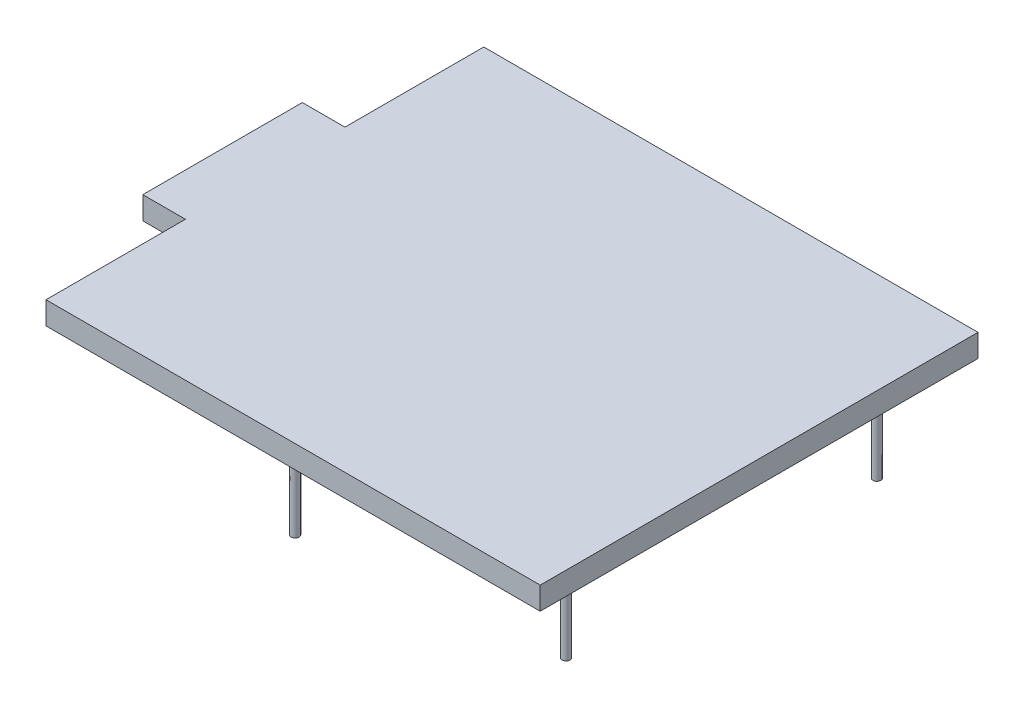
ISO-10303-21;
HEADER;
FILE_DESCRIPTION(('STEP AP214'),'2;1');
FILE_NAME('part.step','',(''),(''),'','','');
FILE_SCHEMA(('AUTOMOTIVE_DESIGN { 1 0 10303 214 1 1 1 1 }'));
ENDSEC;
DATA;
#1=APPLICATION_CONTEXT('core data for automotive mechanical design processes');
#2=APPLICATION_PROTOCOL_DEFINITION('international standard','automotive_design',2000,#1);
#3=PRODUCT_CONTEXT('',#1,'mechanical');
#4=PRODUCT('Part','Part','',(#3));
#5=PRODUCT_RELATED_PRODUCT_CATEGORY('part','',(#4));
#6=PRODUCT_DEFINITION_FORMATION('','',#4);
#7=PRODUCT_DEFINITION_CONTEXT('part definition',#1,'design');
#8=PRODUCT_DEFINITION('design','',#6,#7);
#9=PRODUCT_DEFINITION_SHAPE('','',#8);
#10=(LENGTH_UNIT() NAMED_UNIT(*) SI_UNIT(.MILLI.,.METRE.));
#11=(NAMED_UNIT(*) PLANE_ANGLE_UNIT() SI_UNIT($,.RADIAN.));
#12=(NAMED_UNIT(*) SI_UNIT($,.STERADIAN.) SOLID_ANGLE_UNIT());
#13=UNCERTAINTY_MEASURE_WITH_UNIT(LENGTH_MEASURE(1.E-05),#10,'distance_accuracy_value','');
#14=(GEOMETRIC_REPRESENTATION_CONTEXT(3) GLOBAL_UNCERTAINTY_ASSIGNED_CONTEXT((#13)) GLOBAL_UNIT_ASSIGNED_CONTEXT((#10,
#11,#12)) REPRESENTATION_CONTEXT('',''));
#15=CARTESIAN_POINT('',(0.,0.,0.));
#16=DIRECTION('',(0.,0.,1.));
#17=DIRECTION('',(1.,0.,0.));
#18=AXIS2_PLACEMENT_3D('',#15,#16,#17);
#19=CARTESIAN_POINT('',(414.922512747943,10.,-28.0236520232142));
#20=DIRECTION('',(-1.,0.,0.));
#21=DIRECTION('',(0.,0.,1.));
#22=AXIS2_PLACEMENT_3D('',#19,#20,#21);
#23=PLANE('',#22);
#24=DIRECTION('',(0.,0.,-1.));
#25=VECTOR('',#24,1.);
#26=CARTESIAN_POINT('',(414.922512747943,0.,-28.0236520232142));
#27=LINE('',#26,#25);
#28=CARTESIAN_POINT('',(414.922512747943,0.,165.016347976786));
#29=VERTEX_POINT('',#28);
#30=CARTESIAN_POINT('',(414.922512747943,0.,-28.0236520232142));
#31=VERTEX_POINT('',#30);
#32=EDGE_CURVE('E134',#29,#31,#27,.T.);
#33=ORIENTED_EDGE('',*,*,#32,.T.);
#34=DIRECTION('',(0.,-1.,0.));
#35=VECTOR('',#34,1.);
#36=CARTESIAN_POINT('',(414.922512747943,10.,-28.0236520232142));
#37=LINE('',#36,#35);
#38=CARTESIAN_POINT('',(414.922512747943,10.,-28.0236520232142));
#39=VERTEX_POINT('',#38);
#40=EDGE_CURVE('E162',#39,#31,#37,.T.);
#41=ORIENTED_EDGE('',*,*,#40,.F.);
#42=DIRECTION('',(0.,0.,-1.));
#43=VECTOR('',#42,1.);
#44=CARTESIAN_POINT('',(414.922512747943,10.,-28.0236520232142));
#45=LINE('',#44,#43);
#46=CARTESIAN_POINT('',(414.922512747943,10.,165.016347976786));
#47=VERTEX_POINT('',#46);
#48=EDGE_CURVE('E149',#47,#39,#45,.T.);
#49=ORIENTED_EDGE('',*,*,#48,.F.);
#50=DIRECTION('',(0.,-1.,0.));
#51=VECTOR('',#50,1.);
#52=CARTESIAN_POINT('',(414.922512747943,10.,165.016347976786));
#53=LINE('',#52,#51);
#54=EDGE_CURVE('E130',#47,#29,#53,.T.);
#55=ORIENTED_EDGE('',*,*,#54,.T.);
#56=EDGE_LOOP('',(#33,#41,#49,#55));
#57=FACE_BOUND('',#56,.T.);
#58=ADVANCED_FACE('F37',(#57),#23,.F.);
#59=CARTESIAN_POINT('',(196.990512747943,10.,-28.0236520232142));
#60=DIRECTION('',(0.,0.,1.));
#61=DIRECTION('',(1.,0.,0.));
#62=AXIS2_PLACEMENT_3D('',#59,#60,#61);
#63=PLANE('',#62);
#64=DIRECTION('',(-1.,0.,0.));
#65=VECTOR('',#64,1.);
#66=CARTESIAN_POINT('',(196.990512747943,0.,-28.0236520232142));
#67=LINE('',#66,#65);
#68=CARTESIAN_POINT('',(196.990512747943,0.,-28.0236520232142));
#69=VERTEX_POINT('',#68);
#70=EDGE_CURVE('E137',#31,#69,#67,.T.);
#71=ORIENTED_EDGE('',*,*,#70,.T.);
#72=DIRECTION('',(0.,-1.,0.));
#73=VECTOR('',#72,1.);
#74=CARTESIAN_POINT('',(196.990512747943,10.,-28.0236520232142));
#75=LINE('',#74,#73);
#76=CARTESIAN_POINT('',(196.990512747943,10.,-28.0236520232142));
#77=VERTEX_POINT('',#76);
#78=EDGE_CURVE('E159',#77,#69,#75,.T.);
#79=ORIENTED_EDGE('',*,*,#78,.F.);
#80=DIRECTION('',(-1.,0.,0.));
#81=VECTOR('',#80,1.);
#82=CARTESIAN_POINT('',(196.990512747943,10.,-28.0236520232142));
#83=LINE('',#82,#81);
#84=EDGE_CURVE('E97',#39,#77,#83,.T.);
#85=ORIENTED_EDGE('',*,*,#84,.F.);
#86=ORIENTED_EDGE('',*,*,#40,.T.);
#87=EDGE_LOOP('',(#71,#79,#85,#86));
#88=FACE_BOUND('',#87,.T.);
#89=ADVANCED_FACE('F199',(#88),#63,.F.);
#90=CARTESIAN_POINT('',(196.990512747943,10.,-28.0236520232142));
#91=DIRECTION('',(1.,0.,0.));
#92=DIRECTION('',(0.,0.,-1.));
#93=AXIS2_PLACEMENT_3D('',#90,#91,#92);
#94=PLANE('',#93);
#95=DIRECTION('',(0.,0.,1.));
#96=VECTOR('',#95,1.);
#97=CARTESIAN_POINT('',(196.990512747943,0.,-28.0236520232142));
#98=LINE('',#97,#96);
#99=CARTESIAN_POINT('',(196.990512747943,0.,33.1903479767857));
#100=VERTEX_POINT('',#99);
#101=EDGE_CURVE('E140',#69,#100,#98,.T.);
#102=ORIENTED_EDGE('',*,*,#101,.T.);
#103=DIRECTION('',(0.,-1.,0.));
#104=VECTOR('',#103,1.);
#105=CARTESIAN_POINT('',(196.990512747943,10.,33.1903479767857));
#106=LINE('',#105,#104);
#107=CARTESIAN_POINT('',(196.990512747943,10.,33.1903479767857));
#108=VERTEX_POINT('',#107);
#109=EDGE_CURVE('E156',#108,#100,#106,.T.);
#110=ORIENTED_EDGE('',*,*,#109,.F.);
#111=DIRECTION('',(0.,0.,1.));
#112=VECTOR('',#111,1.);
#113=CARTESIAN_POINT('',(196.990512747943,10.,-28.0236520232142));
#114=LINE('',#113,#112);
#115=EDGE_CURVE('E402',#77,#108,#114,.T.);
#116=ORIENTED_EDGE('',*,*,#115,.F.);
#117=ORIENTED_EDGE('',*,*,#78,.T.);
#118=EDGE_LOOP('',(#102,#110,#116,#117));
#119=FACE_BOUND('',#118,.T.);
#120=ADVANCED_FACE('F203',(#119),#94,.F.);
#121=CARTESIAN_POINT('',(178.194512747943,10.,33.1903479767857));
#122=DIRECTION('',(0.,0.,1.));
#123=DIRECTION('',(1.,0.,0.));
#124=AXIS2_PLACEMENT_3D('',#121,#122,#123);
#125=PLANE('',#124);
#126=DIRECTION('',(-1.,0.,0.));
#127=VECTOR('',#126,1.);
#128=CARTESIAN_POINT('',(178.194512747943,0.,33.1903479767857));
#129=LINE('',#128,#127);
#130=CARTESIAN_POINT('',(178.194512747943,0.,33.1903479767857));
#131=VERTEX_POINT('',#130);
#132=EDGE_CURVE('E142',#100,#131,#129,.T.);
#133=ORIENTED_EDGE('',*,*,#132,.T.);
#134=DIRECTION('',(0.,-1.,0.));
#135=VECTOR('',#134,1.);
#136=CARTESIAN_POINT('',(178.194512747943,10.,33.1903479767857));
#137=LINE('',#136,#135);
#138=CARTESIAN_POINT('',(178.194512747943,10.,33.1903479767857));
#139=VERTEX_POINT('',#138);
#140=EDGE_CURVE('E153',#139,#131,#137,.T.);
#141=ORIENTED_EDGE('',*,*,#140,.F.);
#142=DIRECTION('',(-1.,0.,0.));
#143=VECTOR('',#142,1.);
#144=CARTESIAN_POINT('',(178.194512747943,10.,33.1903479767857));
#145=LINE('',#144,#143);
#146=EDGE_CURVE('E404',#108,#139,#145,.T.);
#147=ORIENTED_EDGE('',*,*,#146,.F.);
#148=ORIENTED_EDGE('',*,*,#109,.T.);
#149=EDGE_LOOP('',(#133,#141,#147,#148));
#150=FACE_BOUND('',#149,.T.);
#151=ADVANCED_FACE('F207',(#150),#125,.F.);
#152=CARTESIAN_POINT('',(178.194512747943,10.,33.1903479767857));
#153=DIRECTION('',(1.,0.,0.));
#154=DIRECTION('',(0.,0.,-1.));
#155=AXIS2_PLACEMENT_3D('',#152,#153,#154);
#156=PLANE('',#155);
#157=DIRECTION('',(0.,0.,1.));
#158=VECTOR('',#157,1.);
#159=CARTESIAN_POINT('',(178.194512747943,0.,33.1903479767857));
#160=LINE('',#159,#158);
#161=CARTESIAN_POINT('',(178.194512747943,0.,103.548347976786));
#162=VERTEX_POINT('',#161);
#163=EDGE_CURVE('E144',#131,#162,#160,.T.);
#164=ORIENTED_EDGE('',*,*,#163,.T.);
#165=DIRECTION('',(0.,-1.,0.));
#166=VECTOR('',#165,1.);
#167=CARTESIAN_POINT('',(178.194512747943,10.,103.548347976786));
#168=LINE('',#167,#166);
#169=CARTESIAN_POINT('',(178.194512747943,10.,103.548347976786));
#170=VERTEX_POINT('',#169);
#171=EDGE_CURVE('E125',#170,#162,#168,.T.);
#172=ORIENTED_EDGE('',*,*,#171,.F.);
#173=DIRECTION('',(0.,0.,1.));
#174=VECTOR('',#173,1.);
#175=CARTESIAN_POINT('',(178.194512747943,10.,33.1903479767857));
#176=LINE('',#175,#174);
#177=EDGE_CURVE('E116',#139,#170,#176,.T.);
#178=ORIENTED_EDGE('',*,*,#177,.F.);
#179=ORIENTED_EDGE('',*,*,#140,.T.);
#180=EDGE_LOOP('',(#164,#172,#178,#179));
#181=FACE_BOUND('',#180,.T.);
#182=ADVANCED_FACE('F213',(#181),#156,.F.);
#183=CARTESIAN_POINT('',(178.194512747943,10.,103.548347976786));
#184=DIRECTION('',(0.,0.,-1.));
#185=DIRECTION('',(-1.,0.,0.));
#186=AXIS2_PLACEMENT_3D('',#183,#184,#185);
#187=PLANE('',#186);
#188=DIRECTION('',(1.,0.,0.));
#189=VECTOR('',#188,1.);
#190=CARTESIAN_POINT('',(178.194512747943,0.,103.548347976786));
#191=LINE('',#190,#189);
#192=CARTESIAN_POINT('',(196.990512747943,0.,103.548347976786));
#193=VERTEX_POINT('',#192);
#194=EDGE_CURVE('E124',#162,#193,#191,.T.);
#195=ORIENTED_EDGE('',*,*,#194,.T.);
#196=DIRECTION('',(0.,-1.,0.));
#197=VECTOR('',#196,1.);
#198=CARTESIAN_POINT('',(196.990512747943,10.,103.548347976786));
#199=LINE('',#198,#197);
#200=CARTESIAN_POINT('',(196.990512747943,10.,103.548347976786));
#201=VERTEX_POINT('',#200);
#202=EDGE_CURVE('E121',#201,#193,#199,.T.);
#203=ORIENTED_EDGE('',*,*,#202,.F.);
#204=DIRECTION('',(1.,0.,0.));
#205=VECTOR('',#204,1.);
#206=CARTESIAN_POINT('',(178.194512747943,10.,103.548347976786));
#207=LINE('',#206,#205);
#208=EDGE_CURVE('E110',#170,#201,#207,.T.);
#209=ORIENTED_EDGE('',*,*,#208,.F.);
#210=ORIENTED_EDGE('',*,*,#171,.T.);
#211=EDGE_LOOP('',(#195,#203,#209,#210));
#212=FACE_BOUND('',#211,.T.);
#213=ADVANCED_FACE('F122',(#212),#187,.F.);
#214=CARTESIAN_POINT('',(196.990512747943,10.,165.016347976786));
#215=DIRECTION('',(1.,0.,0.));
#216=DIRECTION('',(0.,0.,-1.));
#217=AXIS2_PLACEMENT_3D('',#214,#215,#216);
#218=PLANE('',#217);
#219=DIRECTION('',(0.,0.,1.));
#220=VECTOR('',#219,1.);
#221=CARTESIAN_POINT('',(196.990512747943,0.,165.016347976786));
#222=LINE('',#221,#220);
#223=CARTESIAN_POINT('',(196.990512747943,0.,165.016347976786));
#224=VERTEX_POINT('',#223);
#225=EDGE_CURVE('E82',#193,#224,#222,.T.);
#226=ORIENTED_EDGE('',*,*,#225,.T.);
#227=DIRECTION('',(0.,-1.,0.));
#228=VECTOR('',#227,1.);
#229=CARTESIAN_POINT('',(196.990512747943,10.,165.016347976786));
#230=LINE('',#229,#228);
#231=CARTESIAN_POINT('',(196.990512747943,10.,165.016347976786));
#232=VERTEX_POINT('',#231);
#233=EDGE_CURVE('E126',#232,#224,#230,.T.);
#234=ORIENTED_EDGE('',*,*,#233,.F.);
#235=DIRECTION('',(0.,0.,1.));
#236=VECTOR('',#235,1.);
#237=CARTESIAN_POINT('',(196.990512747943,10.,165.016347976786));
#238=LINE('',#237,#236);
#239=EDGE_CURVE('E114',#201,#232,#238,.T.);
#240=ORIENTED_EDGE('',*,*,#239,.F.);
#241=ORIENTED_EDGE('',*,*,#202,.T.);
#242=EDGE_LOOP('',(#226,#234,#240,#241));
#243=FACE_BOUND('',#242,.T.);
#244=ADVANCED_FACE('F128',(#243),#218,.F.);
#245=CARTESIAN_POINT('',(196.990512747943,10.,165.016347976786));
#246=DIRECTION('',(0.,0.,-1.));
#247=DIRECTION('',(-1.,0.,0.));
#248=AXIS2_PLACEMENT_3D('',#245,#246,#247);
#249=PLANE('',#248);
#250=DIRECTION('',(1.,0.,0.));
#251=VECTOR('',#250,1.);
#252=CARTESIAN_POINT('',(196.990512747943,0.,165.016347976786));
#253=LINE('',#252,#251);
#254=EDGE_CURVE('E88',#224,#29,#253,.T.);
#255=ORIENTED_EDGE('',*,*,#254,.T.);
#256=ORIENTED_EDGE('',*,*,#54,.F.);
#257=DIRECTION('',(1.,0.,0.));
#258=VECTOR('',#257,1.);
#259=CARTESIAN_POINT('',(196.990512747943,10.,165.016347976786));
#260=LINE('',#259,#258);
#261=EDGE_CURVE('E53',#232,#47,#260,.T.);
#262=ORIENTED_EDGE('',*,*,#261,.F.);
#263=ORIENTED_EDGE('',*,*,#233,.T.);
#264=EDGE_LOOP('',(#255,#256,#262,#263));
#265=FACE_BOUND('',#264,.T.);
#266=ADVANCED_FACE('F189',(#265),#249,.F.);
#267=CARTESIAN_POINT('',(0.,10.,0.));
#268=DIRECTION('',(0.,1.,0.));
#269=DIRECTION('',(0.,0.,1.));
#270=AXIS2_PLACEMENT_3D('',#267,#268,#269);
#271=PLANE('',#270);
#272=ORIENTED_EDGE('',*,*,#48,.T.);
#273=ORIENTED_EDGE('',*,*,#84,.T.);
#274=ORIENTED_EDGE('',*,*,#115,.T.);
#275=ORIENTED_EDGE('',*,*,#146,.T.);
#276=ORIENTED_EDGE('',*,*,#177,.T.);
#277=ORIENTED_EDGE('',*,*,#208,.T.);
#278=ORIENTED_EDGE('',*,*,#239,.T.);
#279=ORIENTED_EDGE('',*,*,#261,.T.);
#280=EDGE_LOOP('',(#272,#273,#274,#275,#276,#277,#278,#279));
#281=FACE_BOUND('',#280,.T.);
#282=ADVANCED_FACE('F112',(#281),#271,.T.);
#283=CARTESIAN_POINT('',(0.,0.,0.));
#284=DIRECTION('',(0.,1.,0.));
#285=DIRECTION('',(0.,0.,1.));
#286=AXIS2_PLACEMENT_3D('',#283,#284,#285);
#287=PLANE('',#286);
#288=CARTESIAN_POINT('',(291.613302460064,0.,-12.7175107100627));
#289=DIRECTION('',(0.,1.,0.));
#290=DIRECTION('',(0.,0.,1.));
#291=AXIS2_PLACEMENT_3D('',#288,#289,#290);
#292=CIRCLE('',#291,1.74999999999998);
#293=CARTESIAN_POINT('',(291.613302460064,0.,-10.9675107100628));
#294=VERTEX_POINT('',#293);
#295=EDGE_CURVE('E11',#294,#294,#292,.F.);
#296=ORIENTED_EDGE('',*,*,#295,.F.);
#297=EDGE_LOOP('',(#296));
#298=FACE_BOUND('',#297,.T.);
#299=CARTESIAN_POINT('',(398.306929067545,0.,-0.0747479525280703));
#300=DIRECTION('',(0.,1.,0.));
#301=DIRECTION('',(0.,0.,1.));
#302=AXIS2_PLACEMENT_3D('',#299,#300,#301);
#303=CIRCLE('',#302,1.74999999999998);
#304=CARTESIAN_POINT('',(398.306929067545,0.,1.67525204747191));
#305=VERTEX_POINT('',#304);
#306=EDGE_CURVE('E45',#305,#305,#303,.F.);
#307=ORIENTED_EDGE('',*,*,#306,.F.);
#308=EDGE_LOOP('',(#307));
#309=FACE_BOUND('',#308,.T.);
#310=CARTESIAN_POINT('',(398.380512747943,0.,137.085232309362));
#311=DIRECTION('',(0.,1.,0.));
#312=DIRECTION('',(0.,0.,1.));
#313=AXIS2_PLACEMENT_3D('',#310,#311,#312);
#314=CIRCLE('',#313,1.74999999999998);
#315=CARTESIAN_POINT('',(398.380512747943,0.,138.835232309362));
#316=VERTEX_POINT('',#315);
#317=EDGE_CURVE('E167',#316,#316,#314,.F.);
#318=ORIENTED_EDGE('',*,*,#317,.F.);
#319=EDGE_LOOP('',(#318));
#320=FACE_BOUND('',#319,.T.);
#321=CARTESIAN_POINT('',(291.700512747943,0.,149.842465896621));
#322=DIRECTION('',(0.,1.,0.));
#323=DIRECTION('',(0.,0.,1.));
#324=AXIS2_PLACEMENT_3D('',#321,#322,#323);
#325=CIRCLE('',#324,1.74999999999998);
#326=CARTESIAN_POINT('',(291.700512747943,0.,151.592465896621));
#327=VERTEX_POINT('',#326);
#328=EDGE_CURVE('E164',#327,#327,#325,.F.);
#329=ORIENTED_EDGE('',*,*,#328,.F.);
#330=EDGE_LOOP('',(#329));
#331=FACE_BOUND('',#330,.T.);
#332=ORIENTED_EDGE('',*,*,#32,.F.);
#333=ORIENTED_EDGE('',*,*,#254,.F.);
#334=ORIENTED_EDGE('',*,*,#225,.F.);
#335=ORIENTED_EDGE('',*,*,#194,.F.);
#336=ORIENTED_EDGE('',*,*,#163,.F.);
#337=ORIENTED_EDGE('',*,*,#132,.F.);
#338=ORIENTED_EDGE('',*,*,#101,.F.);
#339=ORIENTED_EDGE('',*,*,#70,.F.);
#340=EDGE_LOOP('',(#332,#333,#334,#335,#336,#337,#338,#339));
#341=FACE_BOUND('',#340,.T.);
#342=ADVANCED_FACE('F174',(#298,#309,#320,#331,#341),#287,.F.);
#343=CARTESIAN_POINT('',(291.700512747943,-40.,149.842465896621));
#344=DIRECTION('',(0.,1.,0.));
#345=DIRECTION('',(0.,0.,1.));
#346=AXIS2_PLACEMENT_3D('',#343,#344,#345);
#347=CYLINDRICAL_SURFACE('',#346,1.74999999999998);
#348=CARTESIAN_POINT('',(291.700512747943,-40.,149.842465896621));
#349=DIRECTION('',(0.,-1.,0.));
#350=DIRECTION('',(0.,0.,-1.));
#351=AXIS2_PLACEMENT_3D('',#348,#349,#350);
#352=CIRCLE('',#351,1.74999999999998);
#353=CARTESIAN_POINT('',(291.700512747943,-40.,148.092465896621));
#354=VERTEX_POINT('',#353);
#355=EDGE_CURVE('E138',#354,#354,#352,.T.);
#356=ORIENTED_EDGE('',*,*,#355,.F.);
#357=EDGE_LOOP('',(#356));
#358=FACE_BOUND('',#357,.T.);
#359=ORIENTED_EDGE('',*,*,#328,.T.);
#360=EDGE_LOOP('',(#359));
#361=FACE_BOUND('',#360,.T.);
#362=ADVANCED_FACE('F177',(#358,#361),#347,.T.);
#363=CARTESIAN_POINT('',(291.700512747943,-40.,149.842465896621));
#364=DIRECTION('',(0.,-1.,0.));
#365=DIRECTION('',(0.,0.,-1.));
#366=AXIS2_PLACEMENT_3D('',#363,#364,#365);
#367=PLANE('',#366);
#368=ORIENTED_EDGE('',*,*,#355,.T.);
#369=EDGE_LOOP('',(#368));
#370=FACE_BOUND('',#369,.T.);
#371=ADVANCED_FACE('F256',(#370),#367,.T.);
#372=CARTESIAN_POINT('',(398.380512747943,-40.,137.085232309362));
#373=DIRECTION('',(0.,1.,0.));
#374=DIRECTION('',(0.,0.,1.));
#375=AXIS2_PLACEMENT_3D('',#372,#373,#374);
#376=CYLINDRICAL_SURFACE('',#375,1.74999999999998);
#377=CARTESIAN_POINT('',(398.380512747943,-40.,137.085232309362));
#378=DIRECTION('',(0.,-1.,0.));
#379=DIRECTION('',(0.,0.,-1.));
#380=AXIS2_PLACEMENT_3D('',#377,#378,#379);
#381=CIRCLE('',#380,1.74999999999998);
#382=CARTESIAN_POINT('',(398.380512747943,-40.,135.335232309362));
#383=VERTEX_POINT('',#382);
#384=EDGE_CURVE('E393',#383,#383,#381,.T.);
#385=ORIENTED_EDGE('',*,*,#384,.F.);
#386=EDGE_LOOP('',(#385));
#387=FACE_BOUND('',#386,.T.);
#388=ORIENTED_EDGE('',*,*,#317,.T.);
#389=EDGE_LOOP('',(#388));
#390=FACE_BOUND('',#389,.T.);
#391=ADVANCED_FACE('F267',(#387,#390),#376,.T.);
#392=CARTESIAN_POINT('',(398.380512747943,-40.,137.085232309362));
#393=DIRECTION('',(0.,-1.,0.));
#394=DIRECTION('',(0.,0.,-1.));
#395=AXIS2_PLACEMENT_3D('',#392,#393,#394);
#396=PLANE('',#395);
#397=ORIENTED_EDGE('',*,*,#384,.T.);
#398=EDGE_LOOP('',(#397));
#399=FACE_BOUND('',#398,.T.);
#400=ADVANCED_FACE('F278',(#399),#396,.T.);
#401=CARTESIAN_POINT('',(398.306929067545,-40.,-0.0747479525280703));
#402=DIRECTION('',(0.,1.,0.));
#403=DIRECTION('',(0.,0.,1.));
#404=AXIS2_PLACEMENT_3D('',#401,#402,#403);
#405=CYLINDRICAL_SURFACE('',#404,1.74999999999998);
#406=CARTESIAN_POINT('',(398.306929067545,-40.,-0.0747479525280703));
#407=DIRECTION('',(0.,-1.,0.));
#408=DIRECTION('',(0.,0.,1.));
#409=AXIS2_PLACEMENT_3D('',#406,#407,#408);
#410=CIRCLE('',#409,1.74999999999998);
#411=CARTESIAN_POINT('',(398.306929067545,-40.,1.67525204747191));
#412=VERTEX_POINT('',#411);
#413=EDGE_CURVE('E390',#412,#412,#410,.T.);
#414=ORIENTED_EDGE('',*,*,#413,.F.);
#415=EDGE_LOOP('',(#414));
#416=FACE_BOUND('',#415,.T.);
#417=ORIENTED_EDGE('',*,*,#306,.T.);
#418=EDGE_LOOP('',(#417));
#419=FACE_BOUND('',#418,.T.);
#420=ADVANCED_FACE('F172',(#416,#419),#405,.T.);
#421=CARTESIAN_POINT('',(398.306929067545,-40.,-0.0747479525280703));
#422=DIRECTION('',(0.,1.,0.));
#423=DIRECTION('',(0.,0.,1.));
#424=AXIS2_PLACEMENT_3D('',#421,#422,#423);
#425=PLANE('',#424);
#426=ORIENTED_EDGE('',*,*,#413,.T.);
#427=EDGE_LOOP('',(#426));
#428=FACE_BOUND('',#427,.T.);
#429=ADVANCED_FACE('F299',(#428),#425,.F.);
#430=CARTESIAN_POINT('',(291.613302460064,-40.,-12.7175107100627));
#431=DIRECTION('',(0.,1.,0.));
#432=DIRECTION('',(0.,0.,1.));
#433=AXIS2_PLACEMENT_3D('',#430,#431,#432);
#434=CYLINDRICAL_SURFACE('',#433,1.74999999999998);
#435=CARTESIAN_POINT('',(291.613302460064,-40.,-12.7175107100627));
#436=DIRECTION('',(0.,-1.,0.));
#437=DIRECTION('',(0.,0.,1.));
#438=AXIS2_PLACEMENT_3D('',#435,#436,#437);
#439=CIRCLE('',#438,1.74999999999998);
#440=CARTESIAN_POINT('',(291.613302460064,-40.,-10.9675107100628));
#441=VERTEX_POINT('',#440);
#442=EDGE_CURVE('E389',#441,#441,#439,.T.);
#443=ORIENTED_EDGE('',*,*,#442,.F.);
#444=EDGE_LOOP('',(#443));
#445=FACE_BOUND('',#444,.T.);
#446=ORIENTED_EDGE('',*,*,#295,.T.);
#447=EDGE_LOOP('',(#446));
#448=FACE_BOUND('',#447,.T.);
#449=ADVANCED_FACE('F310',(#445,#448),#434,.T.);
#450=CARTESIAN_POINT('',(291.613302460064,-40.,-12.7175107100627));
#451=DIRECTION('',(0.,1.,0.));
#452=DIRECTION('',(0.,0.,1.));
#453=AXIS2_PLACEMENT_3D('',#450,#451,#452);
#454=PLANE('',#453);
#455=ORIENTED_EDGE('',*,*,#442,.T.);
#456=EDGE_LOOP('',(#455));
#457=FACE_BOUND('',#456,.T.);
#458=ADVANCED_FACE('F321',(#457),#454,.F.);
#459=CLOSED_SHELL('',(#58,#89,#120,#151,#182,#213,#244,#266,#282,#342,#362,#371,#391,#400,#420,
#429,#449,#458));
#460=MANIFOLD_SOLID_BREP('B2',#459);
#461=ADVANCED_BREP_SHAPE_REPRESENTATION('',(#18,#460),#14);
#462=SHAPE_DEFINITION_REPRESENTATION(#9,#461);
ENDSEC;
END-ISO-10303-21;
